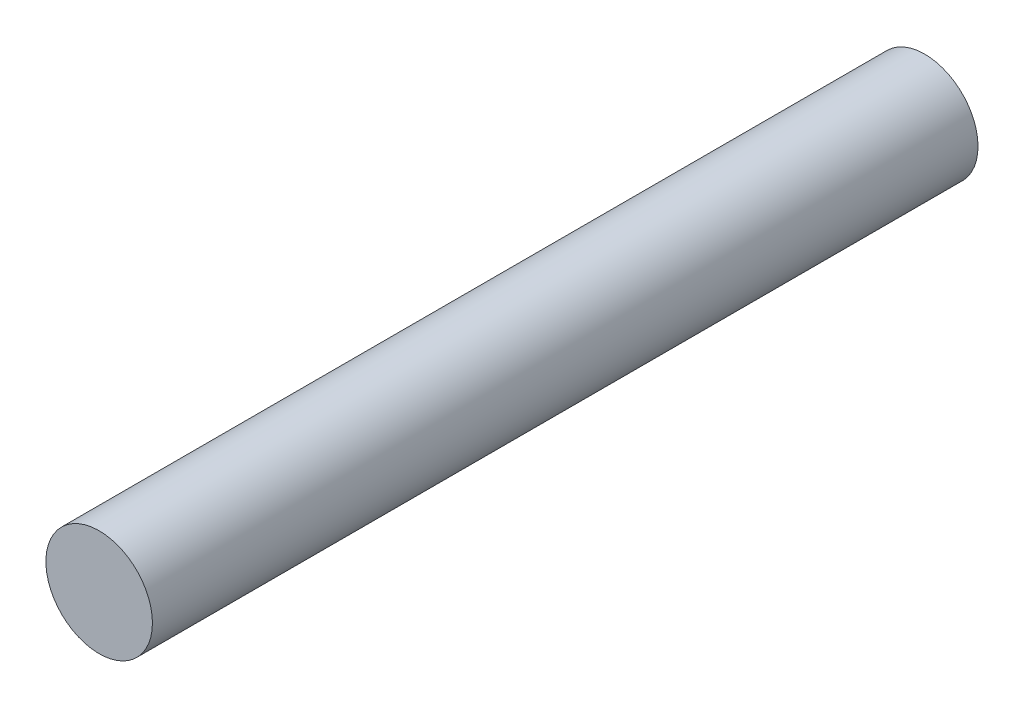
ISO-10303-21;
HEADER;
FILE_DESCRIPTION(('STEP AP214'),'2;1');
FILE_NAME('part.step','',(''),(''),'','','');
FILE_SCHEMA(('AUTOMOTIVE_DESIGN { 1 0 10303 214 1 1 1 1 }'));
ENDSEC;
DATA;
#1=APPLICATION_CONTEXT('core data for automotive mechanical design processes');
#2=APPLICATION_PROTOCOL_DEFINITION('international standard','automotive_design',2000,#1);
#3=PRODUCT_CONTEXT('',#1,'mechanical');
#4=PRODUCT('Part','Part','',(#3));
#5=PRODUCT_RELATED_PRODUCT_CATEGORY('part','',(#4));
#6=PRODUCT_DEFINITION_FORMATION('','',#4);
#7=PRODUCT_DEFINITION_CONTEXT('part definition',#1,'design');
#8=PRODUCT_DEFINITION('design','',#6,#7);
#9=PRODUCT_DEFINITION_SHAPE('','',#8);
#10=(LENGTH_UNIT() NAMED_UNIT(*) SI_UNIT(.MILLI.,.METRE.));
#11=(NAMED_UNIT(*) PLANE_ANGLE_UNIT() SI_UNIT($,.RADIAN.));
#12=(NAMED_UNIT(*) SI_UNIT($,.STERADIAN.) SOLID_ANGLE_UNIT());
#13=UNCERTAINTY_MEASURE_WITH_UNIT(LENGTH_MEASURE(1.E-05),#10,'distance_accuracy_value','');
#14=(GEOMETRIC_REPRESENTATION_CONTEXT(3) GLOBAL_UNCERTAINTY_ASSIGNED_CONTEXT((#13)) GLOBAL_UNIT_ASSIGNED_CONTEXT((#10,
#11,#12)) REPRESENTATION_CONTEXT('',''));
#15=CARTESIAN_POINT('',(0.,0.,0.));
#16=DIRECTION('',(0.,0.,1.));
#17=DIRECTION('',(1.,0.,0.));
#18=AXIS2_PLACEMENT_3D('',#15,#16,#17);
#19=CARTESIAN_POINT('',(0.,0.,62.));
#20=DIRECTION('',(0.,0.,-1.));
#21=DIRECTION('',(-1.,0.,0.));
#22=AXIS2_PLACEMENT_3D('',#19,#20,#21);
#23=CYLINDRICAL_SURFACE('',#22,4.);
#24=CARTESIAN_POINT('',(0.,0.,62.));
#25=DIRECTION('',(0.,0.,1.));
#26=DIRECTION('',(1.,0.,0.));
#27=AXIS2_PLACEMENT_3D('',#24,#25,#26);
#28=CIRCLE('',#27,4.);
#29=CARTESIAN_POINT('',(4.,0.,62.));
#30=VERTEX_POINT('',#29);
#31=EDGE_CURVE('E10',#30,#30,#28,.T.);
#32=ORIENTED_EDGE('',*,*,#31,.F.);
#33=EDGE_LOOP('',(#32));
#34=FACE_BOUND('',#33,.T.);
#35=CARTESIAN_POINT('',(0.,0.,0.));
#36=DIRECTION('',(0.,0.,1.));
#37=DIRECTION('',(1.,0.,0.));
#38=AXIS2_PLACEMENT_3D('',#35,#36,#37);
#39=CIRCLE('',#38,4.);
#40=CARTESIAN_POINT('',(4.,0.,0.));
#41=VERTEX_POINT('',#40);
#42=EDGE_CURVE('E36',#41,#41,#39,.T.);
#43=ORIENTED_EDGE('',*,*,#42,.T.);
#44=EDGE_LOOP('',(#43));
#45=FACE_BOUND('',#44,.T.);
#46=ADVANCED_FACE('F33',(#34,#45),#23,.T.);
#47=CARTESIAN_POINT('',(0.,0.,62.));
#48=DIRECTION('',(0.,0.,1.));
#49=DIRECTION('',(1.,0.,0.));
#50=AXIS2_PLACEMENT_3D('',#47,#48,#49);
#51=PLANE('',#50);
#52=ORIENTED_EDGE('',*,*,#31,.T.);
#53=EDGE_LOOP('',(#52));
#54=FACE_BOUND('',#53,.T.);
#55=ADVANCED_FACE('F48',(#54),#51,.T.);
#56=CARTESIAN_POINT('',(0.,0.,0.));
#57=DIRECTION('',(0.,0.,1.));
#58=DIRECTION('',(1.,0.,0.));
#59=AXIS2_PLACEMENT_3D('',#56,#57,#58);
#60=PLANE('',#59);
#61=ORIENTED_EDGE('',*,*,#42,.F.);
#62=EDGE_LOOP('',(#61));
#63=FACE_BOUND('',#62,.T.);
#64=ADVANCED_FACE('F46',(#63),#60,.F.);
#65=CLOSED_SHELL('',(#46,#55,#64));
#66=MANIFOLD_SOLID_BREP('B2',#65);
#67=ADVANCED_BREP_SHAPE_REPRESENTATION('',(#18,#66),#14);
#68=SHAPE_DEFINITION_REPRESENTATION(#9,#67);
ENDSEC;
END-ISO-10303-21;
